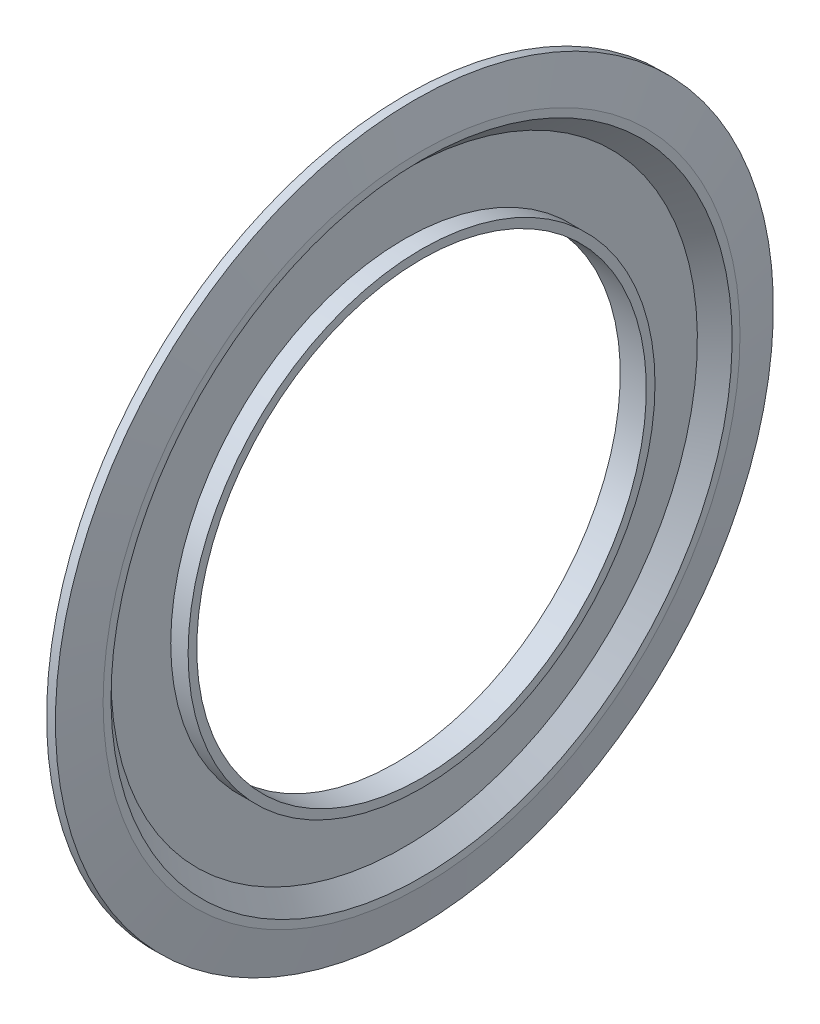
ISO-10303-21;
HEADER;
FILE_DESCRIPTION(('STEP AP214'),'2;1');
FILE_NAME('part.step','',(''),(''),'','','');
FILE_SCHEMA(('AUTOMOTIVE_DESIGN { 1 0 10303 214 1 1 1 1 }'));
ENDSEC;
DATA;
#1=APPLICATION_CONTEXT('core data for automotive mechanical design processes');
#2=APPLICATION_PROTOCOL_DEFINITION('international standard','automotive_design',2000,#1);
#3=PRODUCT_CONTEXT('',#1,'mechanical');
#4=PRODUCT('Part','Part','',(#3));
#5=PRODUCT_RELATED_PRODUCT_CATEGORY('part','',(#4));
#6=PRODUCT_DEFINITION_FORMATION('','',#4);
#7=PRODUCT_DEFINITION_CONTEXT('part definition',#1,'design');
#8=PRODUCT_DEFINITION('design','',#6,#7);
#9=PRODUCT_DEFINITION_SHAPE('','',#8);
#10=(LENGTH_UNIT() NAMED_UNIT(*) SI_UNIT(.MILLI.,.METRE.));
#11=(NAMED_UNIT(*) PLANE_ANGLE_UNIT() SI_UNIT($,.RADIAN.));
#12=(NAMED_UNIT(*) SI_UNIT($,.STERADIAN.) SOLID_ANGLE_UNIT());
#13=UNCERTAINTY_MEASURE_WITH_UNIT(LENGTH_MEASURE(1.E-05),#10,'distance_accuracy_value','');
#14=(GEOMETRIC_REPRESENTATION_CONTEXT(3) GLOBAL_UNCERTAINTY_ASSIGNED_CONTEXT((#13)) GLOBAL_UNIT_ASSIGNED_CONTEXT((#10,
#11,#12)) REPRESENTATION_CONTEXT('',''));
#15=CARTESIAN_POINT('',(0.,0.,0.));
#16=DIRECTION('',(0.,0.,1.));
#17=DIRECTION('',(1.,0.,0.));
#18=AXIS2_PLACEMENT_3D('',#15,#16,#17);
#19=CARTESIAN_POINT('',(0.938918542133543,8.691,0.));
#20=DIRECTION('',(1.,0.,0.));
#21=DIRECTION('',(0.,-1.,0.));
#22=AXIS2_PLACEMENT_3D('',#19,#20,#21);
#23=PLANE('',#22);
#24=CARTESIAN_POINT('',(0.938918542133543,0.,0.));
#25=DIRECTION('',(-1.,0.,0.));
#26=DIRECTION('',(0.,1.,0.));
#27=AXIS2_PLACEMENT_3D('',#24,#25,#26);
#28=CIRCLE('',#27,8.582);
#29=CARTESIAN_POINT('',(0.938918542133543,8.582,0.));
#30=VERTEX_POINT('',#29);
#31=EDGE_CURVE('E11',#30,#30,#28,.T.);
#32=ORIENTED_EDGE('',*,*,#31,.T.);
#33=EDGE_LOOP('',(#32));
#34=FACE_BOUND('',#33,.T.);
#35=CARTESIAN_POINT('',(0.938918542133543,0.,0.));
#36=DIRECTION('',(-1.,0.,0.));
#37=DIRECTION('',(0.,1.,0.));
#38=AXIS2_PLACEMENT_3D('',#35,#36,#37);
#39=CIRCLE('',#38,8.8);
#40=CARTESIAN_POINT('',(0.938918542133543,8.8,0.));
#41=VERTEX_POINT('',#40);
#42=EDGE_CURVE('E76',#41,#41,#39,.T.);
#43=ORIENTED_EDGE('',*,*,#42,.F.);
#44=EDGE_LOOP('',(#43));
#45=FACE_BOUND('',#44,.T.);
#46=ADVANCED_FACE('F16',(#34,#45),#23,.T.);
#47=CARTESIAN_POINT('',(0.698918542133543,0.,0.));
#48=DIRECTION('',(1.,0.,0.));
#49=DIRECTION('',(0.,1.,0.));
#50=AXIS2_PLACEMENT_3D('',#47,#48,#49);
#51=CONICAL_SURFACE('',#50,8.342,0.785398163397448);
#52=CARTESIAN_POINT('',(0.458918542133543,0.,0.));
#53=DIRECTION('',(-1.,0.,0.));
#54=DIRECTION('',(0.,1.,0.));
#55=AXIS2_PLACEMENT_3D('',#52,#53,#54);
#56=CIRCLE('',#55,8.102);
#57=CARTESIAN_POINT('',(0.458918542133543,8.102,0.));
#58=VERTEX_POINT('',#57);
#59=EDGE_CURVE('E20',#58,#58,#56,.T.);
#60=ORIENTED_EDGE('',*,*,#59,.T.);
#61=EDGE_LOOP('',(#60));
#62=FACE_BOUND('',#61,.T.);
#63=ORIENTED_EDGE('',*,*,#31,.F.);
#64=EDGE_LOOP('',(#63));
#65=FACE_BOUND('',#64,.T.);
#66=ADVANCED_FACE('F94',(#62,#65),#51,.F.);
#67=CARTESIAN_POINT('',(0.458918542133543,7.276625,0.));
#68=DIRECTION('',(1.,0.,0.));
#69=DIRECTION('',(0.,-1.,0.));
#70=AXIS2_PLACEMENT_3D('',#67,#68,#69);
#71=PLANE('',#70);
#72=CARTESIAN_POINT('',(0.458918542133543,0.,0.));
#73=DIRECTION('',(-1.,0.,0.));
#74=DIRECTION('',(0.,1.,0.));
#75=AXIS2_PLACEMENT_3D('',#72,#73,#74);
#76=CIRCLE('',#75,6.45125);
#77=CARTESIAN_POINT('',(0.458918542133543,6.45125,0.));
#78=VERTEX_POINT('',#77);
#79=EDGE_CURVE('E61',#78,#78,#76,.T.);
#80=ORIENTED_EDGE('',*,*,#79,.T.);
#81=EDGE_LOOP('',(#80));
#82=FACE_BOUND('',#81,.T.);
#83=ORIENTED_EDGE('',*,*,#59,.F.);
#84=EDGE_LOOP('',(#83));
#85=FACE_BOUND('',#84,.T.);
#86=ADVANCED_FACE('F100',(#82,#85),#71,.T.);
#87=CARTESIAN_POINT('',(0.698918542133543,0.,0.));
#88=DIRECTION('',(1.,0.,0.));
#89=DIRECTION('',(0.,1.,0.));
#90=AXIS2_PLACEMENT_3D('',#87,#88,#89);
#91=CYLINDRICAL_SURFACE('',#90,6.45125);
#92=CARTESIAN_POINT('',(0.938918542133543,0.,0.));
#93=DIRECTION('',(-1.,0.,0.));
#94=DIRECTION('',(0.,1.,0.));
#95=AXIS2_PLACEMENT_3D('',#92,#93,#94);
#96=CIRCLE('',#95,6.45125);
#97=CARTESIAN_POINT('',(0.938918542133543,6.45125,0.));
#98=VERTEX_POINT('',#97);
#99=EDGE_CURVE('E65',#98,#98,#96,.T.);
#100=ORIENTED_EDGE('',*,*,#99,.T.);
#101=EDGE_LOOP('',(#100));
#102=FACE_BOUND('',#101,.T.);
#103=ORIENTED_EDGE('',*,*,#79,.F.);
#104=EDGE_LOOP('',(#103));
#105=FACE_BOUND('',#104,.T.);
#106=ADVANCED_FACE('F66',(#102,#105),#91,.T.);
#107=CARTESIAN_POINT('',(0.938918542133543,6.33125,0.));
#108=DIRECTION('',(1.,0.,0.));
#109=DIRECTION('',(0.,-1.,0.));
#110=AXIS2_PLACEMENT_3D('',#107,#108,#109);
#111=PLANE('',#110);
#112=CARTESIAN_POINT('',(0.938918542133543,0.,0.));
#113=DIRECTION('',(-1.,0.,0.));
#114=DIRECTION('',(0.,1.,0.));
#115=AXIS2_PLACEMENT_3D('',#112,#113,#114);
#116=CIRCLE('',#115,6.21125);
#117=CARTESIAN_POINT('',(0.938918542133543,6.21125,0.));
#118=VERTEX_POINT('',#117);
#119=EDGE_CURVE('E69',#118,#118,#116,.T.);
#120=ORIENTED_EDGE('',*,*,#119,.T.);
#121=EDGE_LOOP('',(#120));
#122=FACE_BOUND('',#121,.T.);
#123=ORIENTED_EDGE('',*,*,#99,.F.);
#124=EDGE_LOOP('',(#123));
#125=FACE_BOUND('',#124,.T.);
#126=ADVANCED_FACE('F107',(#122,#125),#111,.T.);
#127=CARTESIAN_POINT('',(0.578918542133543,0.,0.));
#128=DIRECTION('',(1.,0.,0.));
#129=DIRECTION('',(0.,1.,0.));
#130=AXIS2_PLACEMENT_3D('',#127,#128,#129);
#131=CYLINDRICAL_SURFACE('',#130,6.21125);
#132=CARTESIAN_POINT('',(0.218918542133544,0.,0.));
#133=DIRECTION('',(-1.,0.,0.));
#134=DIRECTION('',(0.,1.,0.));
#135=AXIS2_PLACEMENT_3D('',#132,#133,#134);
#136=CIRCLE('',#135,6.21125);
#137=CARTESIAN_POINT('',(0.218918542133544,6.21125,0.));
#138=VERTEX_POINT('',#137);
#139=EDGE_CURVE('E72',#138,#138,#136,.T.);
#140=ORIENTED_EDGE('',*,*,#139,.T.);
#141=EDGE_LOOP('',(#140));
#142=FACE_BOUND('',#141,.T.);
#143=ORIENTED_EDGE('',*,*,#119,.F.);
#144=EDGE_LOOP('',(#143));
#145=FACE_BOUND('',#144,.T.);
#146=ADVANCED_FACE('F109',(#142,#145),#131,.F.);
#147=CARTESIAN_POINT('',(0.218918542133544,7.20633062748477,0.));
#148=DIRECTION('',(-1.,0.,0.));
#149=DIRECTION('',(0.,1.,0.));
#150=AXIS2_PLACEMENT_3D('',#147,#148,#149);
#151=PLANE('',#150);
#152=CARTESIAN_POINT('',(0.218918542133544,0.,0.));
#153=DIRECTION('',(-1.,0.,0.));
#154=DIRECTION('',(0.,1.,0.));
#155=AXIS2_PLACEMENT_3D('',#152,#153,#154);
#156=CIRCLE('',#155,8.20141125496954);
#157=CARTESIAN_POINT('',(0.218918542133544,8.20141125496954,0.));
#158=VERTEX_POINT('',#157);
#159=EDGE_CURVE('E82',#158,#158,#156,.T.);
#160=ORIENTED_EDGE('',*,*,#159,.T.);
#161=EDGE_LOOP('',(#160));
#162=FACE_BOUND('',#161,.T.);
#163=ORIENTED_EDGE('',*,*,#139,.F.);
#164=EDGE_LOOP('',(#163));
#165=FACE_BOUND('',#164,.T.);
#166=ADVANCED_FACE('F135',(#162,#165),#151,.T.);
#167=CARTESIAN_POINT('',(0.458918542133543,0.,0.));
#168=DIRECTION('',(1.,0.,0.));
#169=DIRECTION('',(0.,1.,0.));
#170=AXIS2_PLACEMENT_3D('',#167,#168,#169);
#171=CONICAL_SURFACE('',#170,8.44141125496954,0.78539816339745);
#172=CARTESIAN_POINT('',(0.698918542133543,0.,0.));
#173=DIRECTION('',(-1.,0.,0.));
#174=DIRECTION('',(0.,1.,0.));
#175=AXIS2_PLACEMENT_3D('',#172,#173,#174);
#176=CIRCLE('',#175,8.68141125496954);
#177=CARTESIAN_POINT('',(0.698918542133543,8.68141125496954,0.));
#178=VERTEX_POINT('',#177);
#179=EDGE_CURVE('E83',#178,#178,#176,.T.);
#180=ORIENTED_EDGE('',*,*,#179,.T.);
#181=EDGE_LOOP('',(#180));
#182=FACE_BOUND('',#181,.T.);
#183=ORIENTED_EDGE('',*,*,#159,.F.);
#184=EDGE_LOOP('',(#183));
#185=FACE_BOUND('',#184,.T.);
#186=ADVANCED_FACE('F143',(#182,#185),#171,.T.);
#187=CARTESIAN_POINT('',(0.698918542133543,8.73020698786166,0.));
#188=DIRECTION('',(-1.,0.,0.));
#189=DIRECTION('',(0.,1.,0.));
#190=AXIS2_PLACEMENT_3D('',#187,#188,#189);
#191=PLANE('',#190);
#192=CARTESIAN_POINT('',(0.698918542133543,0.,0.));
#193=DIRECTION('',(-1.,0.,0.));
#194=DIRECTION('',(0.,1.,0.));
#195=AXIS2_PLACEMENT_3D('',#192,#193,#194);
#196=CIRCLE('',#195,8.77900272075378);
#197=CARTESIAN_POINT('',(0.698918542133543,8.77900272075378,0.));
#198=VERTEX_POINT('',#197);
#199=EDGE_CURVE('E79',#198,#198,#196,.T.);
#200=ORIENTED_EDGE('',*,*,#199,.T.);
#201=EDGE_LOOP('',(#200));
#202=FACE_BOUND('',#201,.T.);
#203=ORIENTED_EDGE('',*,*,#179,.F.);
#204=EDGE_LOOP('',(#203));
#205=FACE_BOUND('',#204,.T.);
#206=ADVANCED_FACE('F151',(#202,#205),#191,.T.);
#207=CARTESIAN_POINT('',(0.598324239510514,0.,0.));
#208=DIRECTION('',(-1.,0.,0.));
#209=DIRECTION('',(0.,1.,0.));
#210=AXIS2_PLACEMENT_3D('',#207,#208,#209);
#211=CONICAL_SURFACE('',#210,9.34950136037689,1.39626340159546);
#212=CARTESIAN_POINT('',(0.497729936887484,0.,0.));
#213=DIRECTION('',(-1.,0.,0.));
#214=DIRECTION('',(0.,1.,0.));
#215=AXIS2_PLACEMENT_3D('',#212,#213,#214);
#216=CIRCLE('',#215,9.92);
#217=CARTESIAN_POINT('',(0.497729936887484,9.92,0.));
#218=VERTEX_POINT('',#217);
#219=EDGE_CURVE('E78',#218,#218,#216,.T.);
#220=ORIENTED_EDGE('',*,*,#219,.T.);
#221=EDGE_LOOP('',(#220));
#222=FACE_BOUND('',#221,.T.);
#223=ORIENTED_EDGE('',*,*,#199,.F.);
#224=EDGE_LOOP('',(#223));
#225=FACE_BOUND('',#224,.T.);
#226=ADVANCED_FACE('F159',(#222,#225),#211,.F.);
#227=CARTESIAN_POINT('',(0.619581130313773,0.,0.));
#228=DIRECTION('',(1.,0.,0.));
#229=DIRECTION('',(0.,1.,0.));
#230=AXIS2_PLACEMENT_3D('',#227,#228,#229);
#231=CYLINDRICAL_SURFACE('',#230,9.92);
#232=CARTESIAN_POINT('',(0.741432323740062,0.,0.));
#233=DIRECTION('',(-1.,0.,0.));
#234=DIRECTION('',(0.,1.,0.));
#235=AXIS2_PLACEMENT_3D('',#232,#233,#234);
#236=CIRCLE('',#235,9.92);
#237=CARTESIAN_POINT('',(0.741432323740062,9.92,0.));
#238=VERTEX_POINT('',#237);
#239=EDGE_CURVE('E85',#238,#238,#236,.T.);
#240=ORIENTED_EDGE('',*,*,#239,.T.);
#241=EDGE_LOOP('',(#240));
#242=FACE_BOUND('',#241,.T.);
#243=ORIENTED_EDGE('',*,*,#219,.F.);
#244=EDGE_LOOP('',(#243));
#245=FACE_BOUND('',#244,.T.);
#246=ADVANCED_FACE('F18',(#242,#245),#231,.T.);
#247=CARTESIAN_POINT('',(0.840175432936802,0.,0.));
#248=DIRECTION('',(-1.,0.,0.));
#249=DIRECTION('',(0.,1.,0.));
#250=AXIS2_PLACEMENT_3D('',#247,#248,#249);
#251=CONICAL_SURFACE('',#250,9.36,1.39626340159546);
#252=ORIENTED_EDGE('',*,*,#42,.T.);
#253=EDGE_LOOP('',(#252));
#254=FACE_BOUND('',#253,.T.);
#255=ORIENTED_EDGE('',*,*,#239,.F.);
#256=EDGE_LOOP('',(#255));
#257=FACE_BOUND('',#256,.T.);
#258=ADVANCED_FACE('F90',(#254,#257),#251,.T.);
#259=CLOSED_SHELL('',(#46,#66,#86,#106,#126,#146,#166,#186,#206,#226,#246,#258));
#260=MANIFOLD_SOLID_BREP('B1',#259);
#261=ADVANCED_BREP_SHAPE_REPRESENTATION('',(#18,#260),#14);
#262=SHAPE_DEFINITION_REPRESENTATION(#9,#261);
ENDSEC;
END-ISO-10303-21;
